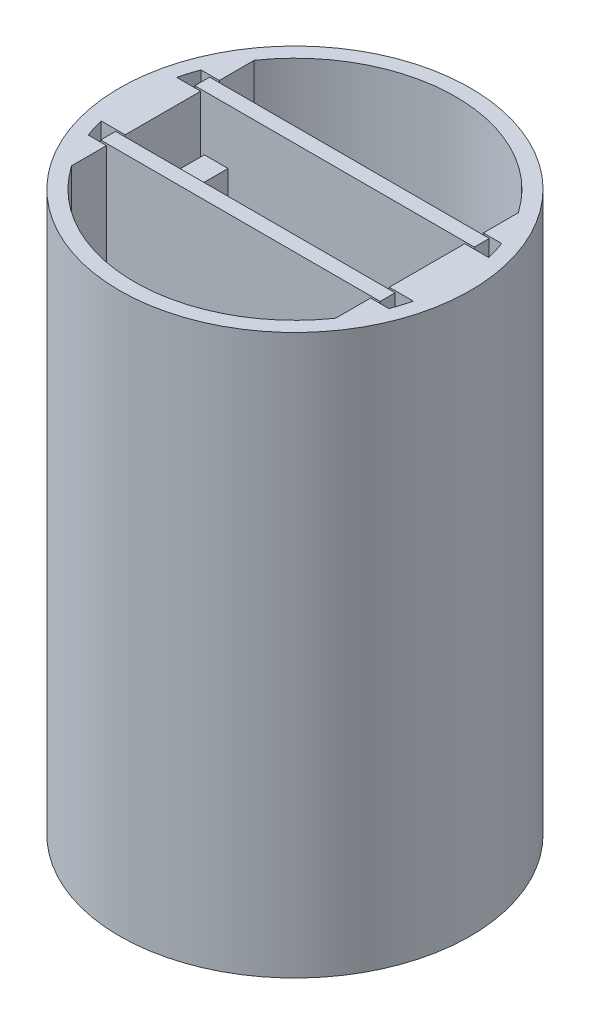
ISO-10303-21;
HEADER;
FILE_DESCRIPTION(('STEP AP214'),'2;1');
FILE_NAME('part.step','',(''),(''),'','','');
FILE_SCHEMA(('AUTOMOTIVE_DESIGN { 1 0 10303 214 1 1 1 1 }'));
ENDSEC;
DATA;
#1=APPLICATION_CONTEXT('core data for automotive mechanical design processes');
#2=APPLICATION_PROTOCOL_DEFINITION('international standard','automotive_design',2000,#1);
#3=PRODUCT_CONTEXT('',#1,'mechanical');
#4=PRODUCT('Part','Part','',(#3));
#5=PRODUCT_RELATED_PRODUCT_CATEGORY('part','',(#4));
#6=PRODUCT_DEFINITION_FORMATION('','',#4);
#7=PRODUCT_DEFINITION_CONTEXT('part definition',#1,'design');
#8=PRODUCT_DEFINITION('design','',#6,#7);
#9=PRODUCT_DEFINITION_SHAPE('','',#8);
#10=(LENGTH_UNIT() NAMED_UNIT(*) SI_UNIT(.MILLI.,.METRE.));
#11=(NAMED_UNIT(*) PLANE_ANGLE_UNIT() SI_UNIT($,.RADIAN.));
#12=(NAMED_UNIT(*) SI_UNIT($,.STERADIAN.) SOLID_ANGLE_UNIT());
#13=UNCERTAINTY_MEASURE_WITH_UNIT(LENGTH_MEASURE(1.E-05),#10,'distance_accuracy_value','');
#14=(GEOMETRIC_REPRESENTATION_CONTEXT(3) GLOBAL_UNCERTAINTY_ASSIGNED_CONTEXT((#13)) GLOBAL_UNIT_ASSIGNED_CONTEXT((#10,
#11,#12)) REPRESENTATION_CONTEXT('',''));
#15=CARTESIAN_POINT('',(0.,0.,0.));
#16=DIRECTION('',(0.,0.,1.));
#17=DIRECTION('',(1.,0.,0.));
#18=AXIS2_PLACEMENT_3D('',#15,#16,#17);
#19=CARTESIAN_POINT('',(15.,55.,-5.85));
#20=DIRECTION('',(0.,-1.,0.));
#21=DIRECTION('',(0.,0.,-1.));
#22=AXIS2_PLACEMENT_3D('',#19,#20,#21);
#23=CYLINDRICAL_SURFACE('',#22,17.2286381240384);
#24=CARTESIAN_POINT('',(15.,-5.,-5.85));
#25=DIRECTION('',(0.,1.,0.));
#26=DIRECTION('',(0.,0.,1.));
#27=AXIS2_PLACEMENT_3D('',#24,#25,#26);
#28=CIRCLE('',#27,17.2286381240384);
#29=CARTESIAN_POINT('',(0.829999999999991,-5.,3.94985059116053));
#30=VERTEX_POINT('',#29);
#31=CARTESIAN_POINT('',(29.17,-5.,3.94985059116052));
#32=VERTEX_POINT('',#31);
#33=EDGE_CURVE('E214',#30,#32,#28,.T.);
#34=ORIENTED_EDGE('',*,*,#33,.F.);
#35=DIRECTION('',(0.,-1.,0.));
#36=VECTOR('',#35,1.);
#37=CARTESIAN_POINT('',(0.829999999999991,55.,3.94985059116053));
#38=LINE('',#37,#36);
#39=CARTESIAN_POINT('',(0.829999999999991,55.,3.94985059116053));
#40=VERTEX_POINT('',#39);
#41=EDGE_CURVE('E12',#40,#30,#38,.T.);
#42=ORIENTED_EDGE('',*,*,#41,.F.);
#43=CARTESIAN_POINT('',(15.,55.,-5.85));
#44=DIRECTION('',(0.,1.,0.));
#45=DIRECTION('',(0.,0.,1.));
#46=AXIS2_PLACEMENT_3D('',#43,#44,#45);
#47=CIRCLE('',#46,17.2286381240384);
#48=CARTESIAN_POINT('',(29.17,55.,3.94985059116052));
#49=VERTEX_POINT('',#48);
#50=EDGE_CURVE('E204',#40,#49,#47,.T.);
#51=ORIENTED_EDGE('',*,*,#50,.T.);
#52=DIRECTION('',(0.,-1.,0.));
#53=VECTOR('',#52,1.);
#54=CARTESIAN_POINT('',(29.17,55.,3.94985059116052));
#55=LINE('',#54,#53);
#56=EDGE_CURVE('E129',#49,#32,#55,.T.);
#57=ORIENTED_EDGE('',*,*,#56,.T.);
#58=EDGE_LOOP('',(#34,#42,#51,#57));
#59=FACE_BOUND('',#58,.T.);
#60=ADVANCED_FACE('F42',(#59),#23,.F.);
#61=CARTESIAN_POINT('',(0.829999999999989,55.,0.));
#62=DIRECTION('',(1.,0.,0.));
#63=DIRECTION('',(0.,0.,-1.));
#64=AXIS2_PLACEMENT_3D('',#61,#62,#63);
#65=PLANE('',#64);
#66=DIRECTION('',(0.,0.,1.));
#67=VECTOR('',#66,1.);
#68=CARTESIAN_POINT('',(0.829999999999989,-5.,0.));
#69=LINE('',#68,#67);
#70=CARTESIAN_POINT('',(0.829999999999989,-5.,0.2));
#71=VERTEX_POINT('',#70);
#72=EDGE_CURVE('E217',#71,#30,#69,.T.);
#73=ORIENTED_EDGE('',*,*,#72,.F.);
#74=DIRECTION('',(0.,-1.,0.));
#75=VECTOR('',#74,1.);
#76=CARTESIAN_POINT('',(0.829999999999989,55.,0.2));
#77=LINE('',#76,#75);
#78=CARTESIAN_POINT('',(0.829999999999989,55.,0.2));
#79=VERTEX_POINT('',#78);
#80=EDGE_CURVE('E51',#79,#71,#77,.T.);
#81=ORIENTED_EDGE('',*,*,#80,.F.);
#82=DIRECTION('',(0.,0.,1.));
#83=VECTOR('',#82,1.);
#84=CARTESIAN_POINT('',(0.829999999999989,55.,0.));
#85=LINE('',#84,#83);
#86=EDGE_CURVE('E309',#79,#40,#85,.T.);
#87=ORIENTED_EDGE('',*,*,#86,.T.);
#88=ORIENTED_EDGE('',*,*,#41,.T.);
#89=EDGE_LOOP('',(#73,#81,#87,#88));
#90=FACE_BOUND('',#89,.T.);
#91=ADVANCED_FACE('F44',(#90),#65,.T.);
#92=CARTESIAN_POINT('',(0.,55.,0.2));
#93=DIRECTION('',(0.,0.,1.));
#94=DIRECTION('',(1.,0.,0.));
#95=AXIS2_PLACEMENT_3D('',#92,#93,#94);
#96=PLANE('',#95);
#97=DIRECTION('',(-1.,0.,0.));
#98=VECTOR('',#97,1.);
#99=CARTESIAN_POINT('',(0.,-5.,0.2));
#100=LINE('',#99,#98);
#101=CARTESIAN_POINT('',(-1.13144356866644,-5.,0.199999999999998));
#102=VERTEX_POINT('',#101);
#103=EDGE_CURVE('E221',#71,#102,#100,.T.);
#104=ORIENTED_EDGE('',*,*,#103,.T.);
#105=DIRECTION('',(0.,-1.,0.));
#106=VECTOR('',#105,1.);
#107=CARTESIAN_POINT('',(-1.13144356866644,55.,0.199999999999998));
#108=LINE('',#107,#106);
#109=CARTESIAN_POINT('',(-1.13144356866644,55.,0.199999999999998));
#110=VERTEX_POINT('',#109);
#111=EDGE_CURVE('E293',#110,#102,#108,.T.);
#112=ORIENTED_EDGE('',*,*,#111,.F.);
#113=DIRECTION('',(-1.,0.,0.));
#114=VECTOR('',#113,1.);
#115=CARTESIAN_POINT('',(0.,55.,0.2));
#116=LINE('',#115,#114);
#117=EDGE_CURVE('E300',#79,#110,#116,.T.);
#118=ORIENTED_EDGE('',*,*,#117,.F.);
#119=ORIENTED_EDGE('',*,*,#80,.T.);
#120=EDGE_LOOP('',(#104,#112,#118,#119));
#121=FACE_BOUND('',#120,.T.);
#122=ADVANCED_FACE('F297',(#121),#96,.F.);
#123=CARTESIAN_POINT('',(-1.74584938452122,-5.,-1.8));
#124=VERTEX_POINT('',#123);
#125=EDGE_CURVE('E218',#124,#102,#28,.T.);
#126=ORIENTED_EDGE('',*,*,#125,.F.);
#127=DIRECTION('',(0.,-1.,0.));
#128=VECTOR('',#127,1.);
#129=CARTESIAN_POINT('',(-1.74584938452122,55.,-1.8));
#130=LINE('',#129,#128);
#131=CARTESIAN_POINT('',(-1.74584938452122,55.,-1.8));
#132=VERTEX_POINT('',#131);
#133=EDGE_CURVE('E291',#132,#124,#130,.T.);
#134=ORIENTED_EDGE('',*,*,#133,.F.);
#135=EDGE_CURVE('E311',#132,#110,#47,.T.);
#136=ORIENTED_EDGE('',*,*,#135,.T.);
#137=ORIENTED_EDGE('',*,*,#111,.T.);
#138=EDGE_LOOP('',(#126,#134,#136,#137));
#139=FACE_BOUND('',#138,.T.);
#140=ADVANCED_FACE('F385',(#139),#23,.F.);
#141=CARTESIAN_POINT('',(0.,55.,-1.8));
#142=DIRECTION('',(0.,0.,1.));
#143=DIRECTION('',(1.,0.,0.));
#144=AXIS2_PLACEMENT_3D('',#141,#142,#143);
#145=PLANE('',#144);
#146=DIRECTION('',(-1.,0.,0.));
#147=VECTOR('',#146,1.);
#148=CARTESIAN_POINT('',(0.,-5.,-1.8));
#149=LINE('',#148,#147);
#150=CARTESIAN_POINT('',(0.829999999999989,-5.,-1.8));
#151=VERTEX_POINT('',#150);
#152=EDGE_CURVE('E224',#151,#124,#149,.T.);
#153=ORIENTED_EDGE('',*,*,#152,.F.);
#154=DIRECTION('',(0.,-1.,0.));
#155=VECTOR('',#154,1.);
#156=CARTESIAN_POINT('',(0.829999999999989,55.,-1.8));
#157=LINE('',#156,#155);
#158=CARTESIAN_POINT('',(0.829999999999989,55.,-1.8));
#159=VERTEX_POINT('',#158);
#160=EDGE_CURVE('E289',#159,#151,#157,.T.);
#161=ORIENTED_EDGE('',*,*,#160,.F.);
#162=DIRECTION('',(-1.,0.,0.));
#163=VECTOR('',#162,1.);
#164=CARTESIAN_POINT('',(0.,55.,-1.8));
#165=LINE('',#164,#163);
#166=EDGE_CURVE('E314',#159,#132,#165,.T.);
#167=ORIENTED_EDGE('',*,*,#166,.T.);
#168=ORIENTED_EDGE('',*,*,#133,.T.);
#169=EDGE_LOOP('',(#153,#161,#167,#168));
#170=FACE_BOUND('',#169,.T.);
#171=ADVANCED_FACE('F383',(#170),#145,.T.);
#172=CARTESIAN_POINT('',(0.829999999999989,55.,0.));
#173=DIRECTION('',(1.,0.,0.));
#174=DIRECTION('',(0.,0.,-1.));
#175=AXIS2_PLACEMENT_3D('',#172,#173,#174);
#176=PLANE('',#175);
#177=DIRECTION('',(0.,0.,1.));
#178=VECTOR('',#177,1.);
#179=CARTESIAN_POINT('',(0.829999999999989,-5.,0.));
#180=LINE('',#179,#178);
#181=CARTESIAN_POINT('',(0.829999999999989,-5.,-9.9));
#182=VERTEX_POINT('',#181);
#183=EDGE_CURVE('E227',#182,#151,#180,.T.);
#184=ORIENTED_EDGE('',*,*,#183,.F.);
#185=DIRECTION('',(0.,-1.,0.));
#186=VECTOR('',#185,1.);
#187=CARTESIAN_POINT('',(0.829999999999989,55.,-9.9));
#188=LINE('',#187,#186);
#189=CARTESIAN_POINT('',(0.829999999999989,55.,-9.9));
#190=VERTEX_POINT('',#189);
#191=EDGE_CURVE('E287',#190,#182,#188,.T.);
#192=ORIENTED_EDGE('',*,*,#191,.F.);
#193=DIRECTION('',(0.,0.,1.));
#194=VECTOR('',#193,1.);
#195=CARTESIAN_POINT('',(0.829999999999989,55.,0.));
#196=LINE('',#195,#194);
#197=EDGE_CURVE('E319',#190,#159,#196,.T.);
#198=ORIENTED_EDGE('',*,*,#197,.T.);
#199=ORIENTED_EDGE('',*,*,#160,.T.);
#200=EDGE_LOOP('',(#184,#192,#198,#199));
#201=FACE_BOUND('',#200,.T.);
#202=ADVANCED_FACE('F380',(#201),#176,.T.);
#203=CARTESIAN_POINT('',(0.,55.,-9.9));
#204=DIRECTION('',(0.,0.,-1.));
#205=DIRECTION('',(-1.,0.,0.));
#206=AXIS2_PLACEMENT_3D('',#203,#204,#205);
#207=PLANE('',#206);
#208=DIRECTION('',(1.,0.,0.));
#209=VECTOR('',#208,1.);
#210=CARTESIAN_POINT('',(0.,-5.,-9.9));
#211=LINE('',#210,#209);
#212=CARTESIAN_POINT('',(-1.74584938452122,-5.,-9.9));
#213=VERTEX_POINT('',#212);
#214=EDGE_CURVE('E230',#213,#182,#211,.T.);
#215=ORIENTED_EDGE('',*,*,#214,.F.);
#216=DIRECTION('',(0.,-1.,0.));
#217=VECTOR('',#216,1.);
#218=CARTESIAN_POINT('',(-1.74584938452122,55.,-9.9));
#219=LINE('',#218,#217);
#220=CARTESIAN_POINT('',(-1.74584938452122,55.,-9.9));
#221=VERTEX_POINT('',#220);
#222=EDGE_CURVE('E285',#221,#213,#219,.T.);
#223=ORIENTED_EDGE('',*,*,#222,.F.);
#224=DIRECTION('',(1.,0.,0.));
#225=VECTOR('',#224,1.);
#226=CARTESIAN_POINT('',(0.,55.,-9.9));
#227=LINE('',#226,#225);
#228=EDGE_CURVE('E324',#221,#190,#227,.T.);
#229=ORIENTED_EDGE('',*,*,#228,.T.);
#230=ORIENTED_EDGE('',*,*,#191,.T.);
#231=EDGE_LOOP('',(#215,#223,#229,#230));
#232=FACE_BOUND('',#231,.T.);
#233=ADVANCED_FACE('F375',(#232),#207,.T.);
#234=CARTESIAN_POINT('',(-1.13144356866644,-5.,-11.9));
#235=VERTEX_POINT('',#234);
#236=EDGE_CURVE('E233',#235,#213,#28,.T.);
#237=ORIENTED_EDGE('',*,*,#236,.F.);
#238=DIRECTION('',(0.,-1.,0.));
#239=VECTOR('',#238,1.);
#240=CARTESIAN_POINT('',(-1.13144356866644,55.,-11.9));
#241=LINE('',#240,#239);
#242=CARTESIAN_POINT('',(-1.13144356866644,55.,-11.9));
#243=VERTEX_POINT('',#242);
#244=EDGE_CURVE('E283',#243,#235,#241,.T.);
#245=ORIENTED_EDGE('',*,*,#244,.F.);
#246=EDGE_CURVE('E315',#243,#221,#47,.T.);
#247=ORIENTED_EDGE('',*,*,#246,.T.);
#248=ORIENTED_EDGE('',*,*,#222,.T.);
#249=EDGE_LOOP('',(#237,#245,#247,#248));
#250=FACE_BOUND('',#249,.T.);
#251=ADVANCED_FACE('F372',(#250),#23,.F.);
#252=CARTESIAN_POINT('',(0.,55.,-11.9));
#253=DIRECTION('',(0.,0.,1.));
#254=DIRECTION('',(1.,0.,0.));
#255=AXIS2_PLACEMENT_3D('',#252,#253,#254);
#256=PLANE('',#255);
#257=DIRECTION('',(-1.,0.,0.));
#258=VECTOR('',#257,1.);
#259=CARTESIAN_POINT('',(0.,-5.,-11.9));
#260=LINE('',#259,#258);
#261=CARTESIAN_POINT('',(0.829999999999989,-5.,-11.9));
#262=VERTEX_POINT('',#261);
#263=EDGE_CURVE('E234',#262,#235,#260,.T.);
#264=ORIENTED_EDGE('',*,*,#263,.F.);
#265=DIRECTION('',(0.,-1.,0.));
#266=VECTOR('',#265,1.);
#267=CARTESIAN_POINT('',(0.829999999999989,55.,-11.9));
#268=LINE('',#267,#266);
#269=CARTESIAN_POINT('',(0.829999999999989,55.,-11.9));
#270=VERTEX_POINT('',#269);
#271=EDGE_CURVE('E281',#270,#262,#268,.T.);
#272=ORIENTED_EDGE('',*,*,#271,.F.);
#273=DIRECTION('',(-1.,0.,0.));
#274=VECTOR('',#273,1.);
#275=CARTESIAN_POINT('',(0.,55.,-11.9));
#276=LINE('',#275,#274);
#277=EDGE_CURVE('E323',#270,#243,#276,.T.);
#278=ORIENTED_EDGE('',*,*,#277,.T.);
#279=ORIENTED_EDGE('',*,*,#244,.T.);
#280=EDGE_LOOP('',(#264,#272,#278,#279));
#281=FACE_BOUND('',#280,.T.);
#282=ADVANCED_FACE('F396',(#281),#256,.T.);
#283=CARTESIAN_POINT('',(0.829999999999979,55.,0.));
#284=DIRECTION('',(-1.,0.,0.));
#285=DIRECTION('',(0.,0.,1.));
#286=AXIS2_PLACEMENT_3D('',#283,#284,#285);
#287=PLANE('',#286);
#288=DIRECTION('',(0.,0.,-1.));
#289=VECTOR('',#288,1.);
#290=CARTESIAN_POINT('',(0.829999999999979,-5.,0.));
#291=LINE('',#290,#289);
#292=CARTESIAN_POINT('',(0.829999999999991,-5.,-15.6498505911605));
#293=VERTEX_POINT('',#292);
#294=EDGE_CURVE('E237',#262,#293,#291,.T.);
#295=ORIENTED_EDGE('',*,*,#294,.T.);
#296=DIRECTION('',(0.,-1.,0.));
#297=VECTOR('',#296,1.);
#298=CARTESIAN_POINT('',(0.829999999999991,55.,-15.6498505911605));
#299=LINE('',#298,#297);
#300=CARTESIAN_POINT('',(0.829999999999991,55.,-15.6498505911605));
#301=VERTEX_POINT('',#300);
#302=EDGE_CURVE('E279',#301,#293,#299,.T.);
#303=ORIENTED_EDGE('',*,*,#302,.F.);
#304=DIRECTION('',(0.,0.,-1.));
#305=VECTOR('',#304,1.);
#306=CARTESIAN_POINT('',(0.829999999999979,55.,0.));
#307=LINE('',#306,#305);
#308=EDGE_CURVE('E329',#270,#301,#307,.T.);
#309=ORIENTED_EDGE('',*,*,#308,.F.);
#310=ORIENTED_EDGE('',*,*,#271,.T.);
#311=EDGE_LOOP('',(#295,#303,#309,#310));
#312=FACE_BOUND('',#311,.T.);
#313=ADVANCED_FACE('F421',(#312),#287,.F.);
#314=CARTESIAN_POINT('',(29.17,-5.,-15.6498505911605));
#315=VERTEX_POINT('',#314);
#316=EDGE_CURVE('E240',#315,#293,#28,.T.);
#317=ORIENTED_EDGE('',*,*,#316,.F.);
#318=DIRECTION('',(0.,-1.,0.));
#319=VECTOR('',#318,1.);
#320=CARTESIAN_POINT('',(29.17,55.,-15.6498505911605));
#321=LINE('',#320,#319);
#322=CARTESIAN_POINT('',(29.17,55.,-15.6498505911605));
#323=VERTEX_POINT('',#322);
#324=EDGE_CURVE('E277',#323,#315,#321,.T.);
#325=ORIENTED_EDGE('',*,*,#324,.F.);
#326=EDGE_CURVE('E325',#323,#301,#47,.T.);
#327=ORIENTED_EDGE('',*,*,#326,.T.);
#328=ORIENTED_EDGE('',*,*,#302,.T.);
#329=EDGE_LOOP('',(#317,#325,#327,#328));
#330=FACE_BOUND('',#329,.T.);
#331=ADVANCED_FACE('F397',(#330),#23,.F.);
#332=CARTESIAN_POINT('',(29.17,55.,0.));
#333=DIRECTION('',(-1.,0.,0.));
#334=DIRECTION('',(0.,0.,1.));
#335=AXIS2_PLACEMENT_3D('',#332,#333,#334);
#336=PLANE('',#335);
#337=DIRECTION('',(0.,0.,-1.));
#338=VECTOR('',#337,1.);
#339=CARTESIAN_POINT('',(29.17,-5.,0.));
#340=LINE('',#339,#338);
#341=CARTESIAN_POINT('',(29.17,-5.,-11.9));
#342=VERTEX_POINT('',#341);
#343=EDGE_CURVE('E241',#342,#315,#340,.T.);
#344=ORIENTED_EDGE('',*,*,#343,.F.);
#345=DIRECTION('',(0.,-1.,0.));
#346=VECTOR('',#345,1.);
#347=CARTESIAN_POINT('',(29.17,55.,-11.9));
#348=LINE('',#347,#346);
#349=CARTESIAN_POINT('',(29.17,55.,-11.9));
#350=VERTEX_POINT('',#349);
#351=EDGE_CURVE('E275',#350,#342,#348,.T.);
#352=ORIENTED_EDGE('',*,*,#351,.F.);
#353=DIRECTION('',(0.,0.,-1.));
#354=VECTOR('',#353,1.);
#355=CARTESIAN_POINT('',(29.17,55.,0.));
#356=LINE('',#355,#354);
#357=EDGE_CURVE('E334',#350,#323,#356,.T.);
#358=ORIENTED_EDGE('',*,*,#357,.T.);
#359=ORIENTED_EDGE('',*,*,#324,.T.);
#360=EDGE_LOOP('',(#344,#352,#358,#359));
#361=FACE_BOUND('',#360,.T.);
#362=ADVANCED_FACE('F417',(#361),#336,.T.);
#363=CARTESIAN_POINT('',(0.,55.,-11.9));
#364=DIRECTION('',(0.,0.,-1.));
#365=DIRECTION('',(-1.,0.,0.));
#366=AXIS2_PLACEMENT_3D('',#363,#364,#365);
#367=PLANE('',#366);
#368=DIRECTION('',(1.,0.,0.));
#369=VECTOR('',#368,1.);
#370=CARTESIAN_POINT('',(0.,-5.,-11.9));
#371=LINE('',#370,#369);
#372=CARTESIAN_POINT('',(31.1314435686664,-5.,-11.9));
#373=VERTEX_POINT('',#372);
#374=EDGE_CURVE('E244',#342,#373,#371,.T.);
#375=ORIENTED_EDGE('',*,*,#374,.T.);
#376=DIRECTION('',(0.,-1.,0.));
#377=VECTOR('',#376,1.);
#378=CARTESIAN_POINT('',(31.1314435686664,55.,-11.9));
#379=LINE('',#378,#377);
#380=CARTESIAN_POINT('',(31.1314435686664,55.,-11.9));
#381=VERTEX_POINT('',#380);
#382=EDGE_CURVE('E273',#381,#373,#379,.T.);
#383=ORIENTED_EDGE('',*,*,#382,.F.);
#384=DIRECTION('',(1.,0.,0.));
#385=VECTOR('',#384,1.);
#386=CARTESIAN_POINT('',(0.,55.,-11.9));
#387=LINE('',#386,#385);
#388=EDGE_CURVE('E338',#350,#381,#387,.T.);
#389=ORIENTED_EDGE('',*,*,#388,.F.);
#390=ORIENTED_EDGE('',*,*,#351,.T.);
#391=EDGE_LOOP('',(#375,#383,#389,#390));
#392=FACE_BOUND('',#391,.T.);
#393=ADVANCED_FACE('F410',(#392),#367,.F.);
#394=CARTESIAN_POINT('',(31.7458493845212,-5.,-9.9));
#395=VERTEX_POINT('',#394);
#396=EDGE_CURVE('E247',#395,#373,#28,.T.);
#397=ORIENTED_EDGE('',*,*,#396,.F.);
#398=DIRECTION('',(0.,-1.,0.));
#399=VECTOR('',#398,1.);
#400=CARTESIAN_POINT('',(31.7458493845212,55.,-9.9));
#401=LINE('',#400,#399);
#402=CARTESIAN_POINT('',(31.7458493845212,55.,-9.9));
#403=VERTEX_POINT('',#402);
#404=EDGE_CURVE('E271',#403,#395,#401,.T.);
#405=ORIENTED_EDGE('',*,*,#404,.F.);
#406=EDGE_CURVE('E203',#403,#381,#47,.T.);
#407=ORIENTED_EDGE('',*,*,#406,.T.);
#408=ORIENTED_EDGE('',*,*,#382,.T.);
#409=EDGE_LOOP('',(#397,#405,#407,#408));
#410=FACE_BOUND('',#409,.T.);
#411=ADVANCED_FACE('F403',(#410),#23,.F.);
#412=CARTESIAN_POINT('',(0.,55.,-9.9));
#413=DIRECTION('',(0.,0.,1.));
#414=DIRECTION('',(1.,0.,0.));
#415=AXIS2_PLACEMENT_3D('',#412,#413,#414);
#416=PLANE('',#415);
#417=DIRECTION('',(-1.,0.,0.));
#418=VECTOR('',#417,1.);
#419=CARTESIAN_POINT('',(0.,-5.,-9.9));
#420=LINE('',#419,#418);
#421=CARTESIAN_POINT('',(29.17,-5.,-9.9));
#422=VERTEX_POINT('',#421);
#423=EDGE_CURVE('E248',#395,#422,#420,.T.);
#424=ORIENTED_EDGE('',*,*,#423,.T.);
#425=DIRECTION('',(0.,-1.,0.));
#426=VECTOR('',#425,1.);
#427=CARTESIAN_POINT('',(29.17,55.,-9.9));
#428=LINE('',#427,#426);
#429=CARTESIAN_POINT('',(29.17,55.,-9.9));
#430=VERTEX_POINT('',#429);
#431=EDGE_CURVE('E268',#430,#422,#428,.T.);
#432=ORIENTED_EDGE('',*,*,#431,.F.);
#433=DIRECTION('',(-1.,0.,0.));
#434=VECTOR('',#433,1.);
#435=CARTESIAN_POINT('',(0.,55.,-9.9));
#436=LINE('',#435,#434);
#437=EDGE_CURVE('E342',#403,#430,#436,.T.);
#438=ORIENTED_EDGE('',*,*,#437,.F.);
#439=ORIENTED_EDGE('',*,*,#404,.T.);
#440=EDGE_LOOP('',(#424,#432,#438,#439));
#441=FACE_BOUND('',#440,.T.);
#442=ADVANCED_FACE('F409',(#441),#416,.F.);
#443=CARTESIAN_POINT('',(29.17,55.,0.));
#444=DIRECTION('',(1.,0.,0.));
#445=DIRECTION('',(0.,0.,-1.));
#446=AXIS2_PLACEMENT_3D('',#443,#444,#445);
#447=PLANE('',#446);
#448=DIRECTION('',(0.,0.,1.));
#449=VECTOR('',#448,1.);
#450=CARTESIAN_POINT('',(29.17,-5.,0.));
#451=LINE('',#450,#449);
#452=CARTESIAN_POINT('',(29.17,-5.,-1.8));
#453=VERTEX_POINT('',#452);
#454=EDGE_CURVE('E250',#422,#453,#451,.T.);
#455=ORIENTED_EDGE('',*,*,#454,.T.);
#456=DIRECTION('',(0.,-1.,0.));
#457=VECTOR('',#456,1.);
#458=CARTESIAN_POINT('',(29.17,55.,-1.8));
#459=LINE('',#458,#457);
#460=CARTESIAN_POINT('',(29.17,55.,-1.8));
#461=VERTEX_POINT('',#460);
#462=EDGE_CURVE('E265',#461,#453,#459,.T.);
#463=ORIENTED_EDGE('',*,*,#462,.F.);
#464=DIRECTION('',(0.,0.,1.));
#465=VECTOR('',#464,1.);
#466=CARTESIAN_POINT('',(29.17,55.,0.));
#467=LINE('',#466,#465);
#468=EDGE_CURVE('E345',#430,#461,#467,.T.);
#469=ORIENTED_EDGE('',*,*,#468,.F.);
#470=ORIENTED_EDGE('',*,*,#431,.T.);
#471=EDGE_LOOP('',(#455,#463,#469,#470));
#472=FACE_BOUND('',#471,.T.);
#473=ADVANCED_FACE('F356',(#472),#447,.F.);
#474=CARTESIAN_POINT('',(0.,55.,-1.8));
#475=DIRECTION('',(0.,0.,-1.));
#476=DIRECTION('',(-1.,0.,0.));
#477=AXIS2_PLACEMENT_3D('',#474,#475,#476);
#478=PLANE('',#477);
#479=DIRECTION('',(1.,0.,0.));
#480=VECTOR('',#479,1.);
#481=CARTESIAN_POINT('',(0.,-5.,-1.8));
#482=LINE('',#481,#480);
#483=CARTESIAN_POINT('',(31.7458493845212,-5.,-1.8));
#484=VERTEX_POINT('',#483);
#485=EDGE_CURVE('E252',#453,#484,#482,.T.);
#486=ORIENTED_EDGE('',*,*,#485,.T.);
#487=DIRECTION('',(0.,-1.,0.));
#488=VECTOR('',#487,1.);
#489=CARTESIAN_POINT('',(31.7458493845212,55.,-1.8));
#490=LINE('',#489,#488);
#491=CARTESIAN_POINT('',(31.7458493845212,55.,-1.8));
#492=VERTEX_POINT('',#491);
#493=EDGE_CURVE('E194',#492,#484,#490,.T.);
#494=ORIENTED_EDGE('',*,*,#493,.F.);
#495=DIRECTION('',(1.,0.,0.));
#496=VECTOR('',#495,1.);
#497=CARTESIAN_POINT('',(0.,55.,-1.8));
#498=LINE('',#497,#496);
#499=EDGE_CURVE('E200',#461,#492,#498,.T.);
#500=ORIENTED_EDGE('',*,*,#499,.F.);
#501=ORIENTED_EDGE('',*,*,#462,.T.);
#502=EDGE_LOOP('',(#486,#494,#500,#501));
#503=FACE_BOUND('',#502,.T.);
#504=ADVANCED_FACE('F360',(#503),#478,.F.);
#505=CARTESIAN_POINT('',(31.1314435686664,-5.,0.199999999999998));
#506=VERTEX_POINT('',#505);
#507=EDGE_CURVE('E189',#506,#484,#28,.T.);
#508=ORIENTED_EDGE('',*,*,#507,.F.);
#509=DIRECTION('',(0.,-1.,0.));
#510=VECTOR('',#509,1.);
#511=CARTESIAN_POINT('',(31.1314435686664,55.,0.199999999999998));
#512=LINE('',#511,#510);
#513=CARTESIAN_POINT('',(31.1314435686664,55.,0.199999999999998));
#514=VERTEX_POINT('',#513);
#515=EDGE_CURVE('E184',#514,#506,#512,.T.);
#516=ORIENTED_EDGE('',*,*,#515,.F.);
#517=EDGE_CURVE('E187',#514,#492,#47,.T.);
#518=ORIENTED_EDGE('',*,*,#517,.T.);
#519=ORIENTED_EDGE('',*,*,#493,.T.);
#520=EDGE_LOOP('',(#508,#516,#518,#519));
#521=FACE_BOUND('',#520,.T.);
#522=ADVANCED_FACE('F186',(#521),#23,.F.);
#523=CARTESIAN_POINT('',(0.,55.,0.200000000000005));
#524=DIRECTION('',(0.,0.,-1.));
#525=DIRECTION('',(-1.,0.,0.));
#526=AXIS2_PLACEMENT_3D('',#523,#524,#525);
#527=PLANE('',#526);
#528=DIRECTION('',(1.,0.,0.));
#529=VECTOR('',#528,1.);
#530=CARTESIAN_POINT('',(0.,-5.,0.200000000000005));
#531=LINE('',#530,#529);
#532=CARTESIAN_POINT('',(29.17,-5.,0.2));
#533=VERTEX_POINT('',#532);
#534=EDGE_CURVE('E255',#533,#506,#531,.T.);
#535=ORIENTED_EDGE('',*,*,#534,.F.);
#536=DIRECTION('',(0.,-1.,0.));
#537=VECTOR('',#536,1.);
#538=CARTESIAN_POINT('',(29.17,55.,0.2));
#539=LINE('',#538,#537);
#540=CARTESIAN_POINT('',(29.17,55.,0.2));
#541=VERTEX_POINT('',#540);
#542=EDGE_CURVE('E122',#541,#533,#539,.T.);
#543=ORIENTED_EDGE('',*,*,#542,.F.);
#544=DIRECTION('',(1.,0.,0.));
#545=VECTOR('',#544,1.);
#546=CARTESIAN_POINT('',(0.,55.,0.200000000000005));
#547=LINE('',#546,#545);
#548=EDGE_CURVE('E198',#541,#514,#547,.T.);
#549=ORIENTED_EDGE('',*,*,#548,.T.);
#550=ORIENTED_EDGE('',*,*,#515,.T.);
#551=EDGE_LOOP('',(#535,#543,#549,#550));
#552=FACE_BOUND('',#551,.T.);
#553=ADVANCED_FACE('F205',(#552),#527,.T.);
#554=CARTESIAN_POINT('',(29.17,55.,0.));
#555=DIRECTION('',(1.,0.,0.));
#556=DIRECTION('',(0.,0.,-1.));
#557=AXIS2_PLACEMENT_3D('',#554,#555,#556);
#558=PLANE('',#557);
#559=DIRECTION('',(0.,0.,1.));
#560=VECTOR('',#559,1.);
#561=CARTESIAN_POINT('',(29.17,-5.,0.));
#562=LINE('',#561,#560);
#563=EDGE_CURVE('E257',#533,#32,#562,.T.);
#564=ORIENTED_EDGE('',*,*,#563,.T.);
#565=ORIENTED_EDGE('',*,*,#56,.F.);
#566=DIRECTION('',(0.,0.,1.));
#567=VECTOR('',#566,1.);
#568=CARTESIAN_POINT('',(29.17,55.,0.));
#569=LINE('',#568,#567);
#570=EDGE_CURVE('E59',#541,#49,#569,.T.);
#571=ORIENTED_EDGE('',*,*,#570,.F.);
#572=ORIENTED_EDGE('',*,*,#542,.T.);
#573=EDGE_LOOP('',(#564,#565,#571,#572));
#574=FACE_BOUND('',#573,.T.);
#575=ADVANCED_FACE('F310',(#574),#558,.F.);
#576=CARTESIAN_POINT('',(15.,55.,-5.85));
#577=DIRECTION('',(0.,-1.,0.));
#578=DIRECTION('',(0.,0.,-1.));
#579=AXIS2_PLACEMENT_3D('',#576,#577,#578);
#580=CYLINDRICAL_SURFACE('',#579,18.8286381240384);
#581=CARTESIAN_POINT('',(15.,55.,-5.85));
#582=DIRECTION('',(0.,1.,0.));
#583=DIRECTION('',(0.,0.,1.));
#584=AXIS2_PLACEMENT_3D('',#581,#582,#583);
#585=CIRCLE('',#584,18.8286381240384);
#586=CARTESIAN_POINT('',(15.,55.,12.9786381240384));
#587=VERTEX_POINT('',#586);
#588=EDGE_CURVE('E207',#587,#587,#585,.T.);
#589=ORIENTED_EDGE('',*,*,#588,.F.);
#590=EDGE_LOOP('',(#589));
#591=FACE_BOUND('',#590,.T.);
#592=CARTESIAN_POINT('',(15.,-5.,-5.85));
#593=DIRECTION('',(0.,1.,0.));
#594=DIRECTION('',(0.,0.,1.));
#595=AXIS2_PLACEMENT_3D('',#592,#593,#594);
#596=CIRCLE('',#595,18.8286381240384);
#597=CARTESIAN_POINT('',(15.,-5.,12.9786381240384));
#598=VERTEX_POINT('',#597);
#599=EDGE_CURVE('E259',#598,#598,#596,.T.);
#600=ORIENTED_EDGE('',*,*,#599,.T.);
#601=EDGE_LOOP('',(#600));
#602=FACE_BOUND('',#601,.T.);
#603=ADVANCED_FACE('F524',(#591,#602),#580,.T.);
#604=CARTESIAN_POINT('',(0.,55.,0.));
#605=DIRECTION('',(0.,1.,0.));
#606=DIRECTION('',(0.,0.,1.));
#607=AXIS2_PLACEMENT_3D('',#604,#605,#606);
#608=PLANE('',#607);
#609=ORIENTED_EDGE('',*,*,#50,.F.);
#610=ORIENTED_EDGE('',*,*,#86,.F.);
#611=ORIENTED_EDGE('',*,*,#117,.T.);
#612=ORIENTED_EDGE('',*,*,#135,.F.);
#613=ORIENTED_EDGE('',*,*,#166,.F.);
#614=ORIENTED_EDGE('',*,*,#197,.F.);
#615=ORIENTED_EDGE('',*,*,#228,.F.);
#616=ORIENTED_EDGE('',*,*,#246,.F.);
#617=ORIENTED_EDGE('',*,*,#277,.F.);
#618=ORIENTED_EDGE('',*,*,#308,.T.);
#619=ORIENTED_EDGE('',*,*,#326,.F.);
#620=ORIENTED_EDGE('',*,*,#357,.F.);
#621=ORIENTED_EDGE('',*,*,#388,.T.);
#622=ORIENTED_EDGE('',*,*,#406,.F.);
#623=ORIENTED_EDGE('',*,*,#437,.T.);
#624=ORIENTED_EDGE('',*,*,#468,.T.);
#625=ORIENTED_EDGE('',*,*,#499,.T.);
#626=ORIENTED_EDGE('',*,*,#517,.F.);
#627=ORIENTED_EDGE('',*,*,#548,.F.);
#628=ORIENTED_EDGE('',*,*,#570,.T.);
#629=EDGE_LOOP('',(#609,#610,#611,#612,#613,#614,#615,#616,#617,#618,#619,#620,#621,#622,#623,
#624,#625,#626,#627,#628));
#630=FACE_BOUND('',#629,.T.);
#631=ORIENTED_EDGE('',*,*,#588,.T.);
#632=EDGE_LOOP('',(#631));
#633=FACE_BOUND('',#632,.T.);
#634=ADVANCED_FACE('F196',(#630,#633),#608,.T.);
#635=CARTESIAN_POINT('',(0.,-5.,0.));
#636=DIRECTION('',(0.,1.,0.));
#637=DIRECTION('',(0.,0.,1.));
#638=AXIS2_PLACEMENT_3D('',#635,#636,#637);
#639=PLANE('',#638);
#640=ORIENTED_EDGE('',*,*,#33,.T.);
#641=ORIENTED_EDGE('',*,*,#563,.F.);
#642=ORIENTED_EDGE('',*,*,#534,.T.);
#643=ORIENTED_EDGE('',*,*,#507,.T.);
#644=ORIENTED_EDGE('',*,*,#485,.F.);
#645=ORIENTED_EDGE('',*,*,#454,.F.);
#646=ORIENTED_EDGE('',*,*,#423,.F.);
#647=ORIENTED_EDGE('',*,*,#396,.T.);
#648=ORIENTED_EDGE('',*,*,#374,.F.);
#649=ORIENTED_EDGE('',*,*,#343,.T.);
#650=ORIENTED_EDGE('',*,*,#316,.T.);
#651=ORIENTED_EDGE('',*,*,#294,.F.);
#652=ORIENTED_EDGE('',*,*,#263,.T.);
#653=ORIENTED_EDGE('',*,*,#236,.T.);
#654=ORIENTED_EDGE('',*,*,#214,.T.);
#655=ORIENTED_EDGE('',*,*,#183,.T.);
#656=ORIENTED_EDGE('',*,*,#152,.T.);
#657=ORIENTED_EDGE('',*,*,#125,.T.);
#658=ORIENTED_EDGE('',*,*,#103,.F.);
#659=ORIENTED_EDGE('',*,*,#72,.T.);
#660=EDGE_LOOP('',(#640,#641,#642,#643,#644,#645,#646,#647,#648,#649,#650,#651,#652,#653,#654,
#655,#656,#657,#658,#659));
#661=FACE_BOUND('',#660,.T.);
#662=ORIENTED_EDGE('',*,*,#599,.F.);
#663=EDGE_LOOP('',(#662));
#664=FACE_BOUND('',#663,.T.);
#665=ADVANCED_FACE('F306',(#661,#664),#639,.F.);
#666=CLOSED_SHELL('',(#60,#91,#122,#140,#171,#202,#233,#251,#282,#313,#331,#362,#393,#411,#442,
#473,#504,#522,#553,#575,#603,#634,#665));
#667=MANIFOLD_SOLID_BREP('B2',#666);
#668=CARTESIAN_POINT('',(0.,0.,-1.6));
#669=DIRECTION('',(0.,0.,-1.));
#670=DIRECTION('',(-1.,0.,0.));
#671=AXIS2_PLACEMENT_3D('',#668,#669,#670);
#672=PLANE('',#671);
#673=DIRECTION('',(1.,0.,0.));
#674=VECTOR('',#673,1.);
#675=CARTESIAN_POINT('',(0.,5.91000000000013,-1.6));
#676=LINE('',#675,#674);
#677=CARTESIAN_POINT('',(26.43,5.91,-1.6));
#678=VERTEX_POINT('',#677);
#679=CARTESIAN_POINT('',(28.97,5.90999999999999,-1.6));
#680=VERTEX_POINT('',#679);
#681=EDGE_CURVE('E792',#678,#680,#676,.T.);
#682=ORIENTED_EDGE('',*,*,#681,.T.);
#683=DIRECTION('',(0.,1.,0.));
#684=VECTOR('',#683,1.);
#685=CARTESIAN_POINT('',(28.97,0.,-1.6));
#686=LINE('',#685,#684);
#687=CARTESIAN_POINT('',(28.97,49.09,-1.6));
#688=VERTEX_POINT('',#687);
#689=EDGE_CURVE('E790',#680,#688,#686,.T.);
#690=ORIENTED_EDGE('',*,*,#689,.T.);
#691=DIRECTION('',(1.,0.,0.));
#692=VECTOR('',#691,1.);
#693=CARTESIAN_POINT('',(0.,49.09,-1.6));
#694=LINE('',#693,#692);
#695=CARTESIAN_POINT('',(26.43,49.09,-1.6));
#696=VERTEX_POINT('',#695);
#697=EDGE_CURVE('E643',#696,#688,#694,.T.);
#698=ORIENTED_EDGE('',*,*,#697,.F.);
#699=DIRECTION('',(0.,1.,0.));
#700=VECTOR('',#699,1.);
#701=CARTESIAN_POINT('',(26.43,0.,-1.6));
#702=LINE('',#701,#700);
#703=EDGE_CURVE('E638',#678,#696,#702,.T.);
#704=ORIENTED_EDGE('',*,*,#703,.F.);
#705=EDGE_LOOP('',(#682,#690,#698,#704));
#706=FACE_BOUND('',#705,.T.);
#707=DIRECTION('',(0.,1.,0.));
#708=VECTOR('',#707,1.);
#709=CARTESIAN_POINT('',(0.,0.,-1.6));
#710=LINE('',#709,#708);
#711=CARTESIAN_POINT('',(0.,0.,-1.6));
#712=VERTEX_POINT('',#711);
#713=CARTESIAN_POINT('',(0.,55.,-1.6));
#714=VERTEX_POINT('',#713);
#715=EDGE_CURVE('E835',#712,#714,#710,.T.);
#716=ORIENTED_EDGE('',*,*,#715,.T.);
#717=DIRECTION('',(1.,0.,0.));
#718=VECTOR('',#717,1.);
#719=CARTESIAN_POINT('',(0.,55.,-1.6));
#720=LINE('',#719,#718);
#721=CARTESIAN_POINT('',(30.,55.,-1.6));
#722=VERTEX_POINT('',#721);
#723=EDGE_CURVE('E838',#714,#722,#720,.T.);
#724=ORIENTED_EDGE('',*,*,#723,.T.);
#725=DIRECTION('',(0.,1.,0.));
#726=VECTOR('',#725,1.);
#727=CARTESIAN_POINT('',(30.,0.,-1.6));
#728=LINE('',#727,#726);
#729=CARTESIAN_POINT('',(30.,0.,-1.6));
#730=VERTEX_POINT('',#729);
#731=EDGE_CURVE('E841',#730,#722,#728,.T.);
#732=ORIENTED_EDGE('',*,*,#731,.F.);
#733=DIRECTION('',(1.,0.,0.));
#734=VECTOR('',#733,1.);
#735=CARTESIAN_POINT('',(0.,0.,-1.6));
#736=LINE('',#735,#734);
#737=EDGE_CURVE('E844',#712,#730,#736,.T.);
#738=ORIENTED_EDGE('',*,*,#737,.F.);
#739=EDGE_LOOP('',(#716,#724,#732,#738));
#740=FACE_BOUND('',#739,.T.);
#741=DIRECTION('',(0.,1.,0.));
#742=VECTOR('',#741,1.);
#743=CARTESIAN_POINT('',(1.02999999999999,0.,-1.6));
#744=LINE('',#743,#742);
#745=CARTESIAN_POINT('',(1.02999999999999,5.91,-1.6));
#746=VERTEX_POINT('',#745);
#747=CARTESIAN_POINT('',(1.02999999999999,49.09,-1.6));
#748=VERTEX_POINT('',#747);
#749=EDGE_CURVE('E817',#746,#748,#744,.T.);
#750=ORIENTED_EDGE('',*,*,#749,.F.);
#751=DIRECTION('',(-1.,0.,0.));
#752=VECTOR('',#751,1.);
#753=CARTESIAN_POINT('',(0.,5.91,-1.6));
#754=LINE('',#753,#752);
#755=CARTESIAN_POINT('',(3.57,5.91,-1.6));
#756=VERTEX_POINT('',#755);
#757=EDGE_CURVE('E794',#756,#746,#754,.T.);
#758=ORIENTED_EDGE('',*,*,#757,.F.);
#759=DIRECTION('',(0.,1.,0.));
#760=VECTOR('',#759,1.);
#761=CARTESIAN_POINT('',(3.57,0.,-1.6));
#762=LINE('',#761,#760);
#763=CARTESIAN_POINT('',(3.56999999999999,49.09,-1.6));
#764=VERTEX_POINT('',#763);
#765=EDGE_CURVE('E806',#756,#764,#762,.T.);
#766=ORIENTED_EDGE('',*,*,#765,.T.);
#767=DIRECTION('',(-1.,0.,0.));
#768=VECTOR('',#767,1.);
#769=CARTESIAN_POINT('',(0.,49.09,-1.6));
#770=LINE('',#769,#768);
#771=EDGE_CURVE('E820',#764,#748,#770,.T.);
#772=ORIENTED_EDGE('',*,*,#771,.T.);
#773=EDGE_LOOP('',(#750,#758,#766,#772));
#774=FACE_BOUND('',#773,.T.);
#775=ADVANCED_FACE('F623',(#706,#740,#774),#672,.T.);
#776=CARTESIAN_POINT('',(0.,0.,-1.6));
#777=DIRECTION('',(1.,0.,0.));
#778=DIRECTION('',(0.,0.,-1.));
#779=AXIS2_PLACEMENT_3D('',#776,#777,#778);
#780=PLANE('',#779);
#781=DIRECTION('',(0.,1.,0.));
#782=VECTOR('',#781,1.);
#783=CARTESIAN_POINT('',(0.,0.,0.));
#784=LINE('',#783,#782);
#785=CARTESIAN_POINT('',(0.,0.,0.));
#786=VERTEX_POINT('',#785);
#787=CARTESIAN_POINT('',(0.,55.,0.));
#788=VERTEX_POINT('',#787);
#789=EDGE_CURVE('E834',#786,#788,#784,.T.);
#790=ORIENTED_EDGE('',*,*,#789,.T.);
#791=DIRECTION('',(0.,0.,1.));
#792=VECTOR('',#791,1.);
#793=CARTESIAN_POINT('',(0.,55.,-1.6));
#794=LINE('',#793,#792);
#795=EDGE_CURVE('E40',#714,#788,#794,.T.);
#796=ORIENTED_EDGE('',*,*,#795,.F.);
#797=ORIENTED_EDGE('',*,*,#715,.F.);
#798=DIRECTION('',(0.,0.,1.));
#799=VECTOR('',#798,1.);
#800=CARTESIAN_POINT('',(0.,0.,-1.6));
#801=LINE('',#800,#799);
#802=EDGE_CURVE('E847',#712,#786,#801,.T.);
#803=ORIENTED_EDGE('',*,*,#802,.T.);
#804=EDGE_LOOP('',(#790,#796,#797,#803));
#805=FACE_BOUND('',#804,.T.);
#806=ADVANCED_FACE('F625',(#805),#780,.F.);
#807=CARTESIAN_POINT('',(0.,55.,-1.6));
#808=DIRECTION('',(0.,-1.,0.));
#809=DIRECTION('',(0.,0.,-1.));
#810=AXIS2_PLACEMENT_3D('',#807,#808,#809);
#811=PLANE('',#810);
#812=DIRECTION('',(1.,0.,0.));
#813=VECTOR('',#812,1.);
#814=CARTESIAN_POINT('',(0.,55.,0.));
#815=LINE('',#814,#813);
#816=CARTESIAN_POINT('',(30.,55.,0.));
#817=VERTEX_POINT('',#816);
#818=EDGE_CURVE('E850',#788,#817,#815,.T.);
#819=ORIENTED_EDGE('',*,*,#818,.T.);
#820=DIRECTION('',(0.,0.,1.));
#821=VECTOR('',#820,1.);
#822=CARTESIAN_POINT('',(30.,55.,-1.6));
#823=LINE('',#822,#821);
#824=EDGE_CURVE('E631',#722,#817,#823,.T.);
#825=ORIENTED_EDGE('',*,*,#824,.F.);
#826=ORIENTED_EDGE('',*,*,#723,.F.);
#827=ORIENTED_EDGE('',*,*,#795,.T.);
#828=EDGE_LOOP('',(#819,#825,#826,#827));
#829=FACE_BOUND('',#828,.T.);
#830=ADVANCED_FACE('F866',(#829),#811,.F.);
#831=CARTESIAN_POINT('',(30.,0.,-1.6));
#832=DIRECTION('',(1.,0.,0.));
#833=DIRECTION('',(0.,0.,-1.));
#834=AXIS2_PLACEMENT_3D('',#831,#832,#833);
#835=PLANE('',#834);
#836=DIRECTION('',(0.,1.,0.));
#837=VECTOR('',#836,1.);
#838=CARTESIAN_POINT('',(30.,0.,0.));
#839=LINE('',#838,#837);
#840=CARTESIAN_POINT('',(30.,0.,0.));
#841=VERTEX_POINT('',#840);
#842=EDGE_CURVE('E853',#841,#817,#839,.T.);
#843=ORIENTED_EDGE('',*,*,#842,.F.);
#844=DIRECTION('',(0.,0.,1.));
#845=VECTOR('',#844,1.);
#846=CARTESIAN_POINT('',(30.,0.,-1.6));
#847=LINE('',#846,#845);
#848=EDGE_CURVE('E859',#730,#841,#847,.T.);
#849=ORIENTED_EDGE('',*,*,#848,.F.);
#850=ORIENTED_EDGE('',*,*,#731,.T.);
#851=ORIENTED_EDGE('',*,*,#824,.T.);
#852=EDGE_LOOP('',(#843,#849,#850,#851));
#853=FACE_BOUND('',#852,.T.);
#854=ADVANCED_FACE('F863',(#853),#835,.T.);
#855=CARTESIAN_POINT('',(0.,0.,-1.6));
#856=DIRECTION('',(0.,-1.,0.));
#857=DIRECTION('',(0.,0.,-1.));
#858=AXIS2_PLACEMENT_3D('',#855,#856,#857);
#859=PLANE('',#858);
#860=DIRECTION('',(1.,0.,0.));
#861=VECTOR('',#860,1.);
#862=CARTESIAN_POINT('',(0.,0.,0.));
#863=LINE('',#862,#861);
#864=EDGE_CURVE('E839',#786,#841,#863,.T.);
#865=ORIENTED_EDGE('',*,*,#864,.F.);
#866=ORIENTED_EDGE('',*,*,#802,.F.);
#867=ORIENTED_EDGE('',*,*,#737,.T.);
#868=ORIENTED_EDGE('',*,*,#848,.T.);
#869=EDGE_LOOP('',(#865,#866,#867,#868));
#870=FACE_BOUND('',#869,.T.);
#871=ADVANCED_FACE('F873',(#870),#859,.T.);
#872=CARTESIAN_POINT('',(0.,0.,0.));
#873=DIRECTION('',(0.,0.,-1.));
#874=DIRECTION('',(-1.,0.,0.));
#875=AXIS2_PLACEMENT_3D('',#872,#873,#874);
#876=PLANE('',#875);
#877=ORIENTED_EDGE('',*,*,#789,.F.);
#878=ORIENTED_EDGE('',*,*,#864,.T.);
#879=ORIENTED_EDGE('',*,*,#842,.T.);
#880=ORIENTED_EDGE('',*,*,#818,.F.);
#881=EDGE_LOOP('',(#877,#878,#879,#880));
#882=FACE_BOUND('',#881,.T.);
#883=ADVANCED_FACE('F870',(#882),#876,.F.);
#884=CARTESIAN_POINT('',(0.,5.91,-10.1));
#885=DIRECTION('',(0.,1.,0.));
#886=DIRECTION('',(-1.,0.,0.));
#887=AXIS2_PLACEMENT_3D('',#884,#885,#886);
#888=PLANE('',#887);
#889=ORIENTED_EDGE('',*,*,#757,.T.);
#890=DIRECTION('',(0.,0.,1.));
#891=VECTOR('',#890,1.);
#892=CARTESIAN_POINT('',(1.02999999999999,5.91,-10.1));
#893=LINE('',#892,#891);
#894=CARTESIAN_POINT('',(1.02999999999999,5.91,-10.1));
#895=VERTEX_POINT('',#894);
#896=EDGE_CURVE('E831',#895,#746,#893,.T.);
#897=ORIENTED_EDGE('',*,*,#896,.F.);
#898=DIRECTION('',(-1.,0.,0.));
#899=VECTOR('',#898,1.);
#900=CARTESIAN_POINT('',(0.,5.91,-10.1));
#901=LINE('',#900,#899);
#902=CARTESIAN_POINT('',(3.57,5.91,-10.1));
#903=VERTEX_POINT('',#902);
#904=EDGE_CURVE('E803',#903,#895,#901,.T.);
#905=ORIENTED_EDGE('',*,*,#904,.F.);
#906=DIRECTION('',(0.,0.,1.));
#907=VECTOR('',#906,1.);
#908=CARTESIAN_POINT('',(3.57,5.91,-10.1));
#909=LINE('',#908,#907);
#910=EDGE_CURVE('E814',#903,#756,#909,.T.);
#911=ORIENTED_EDGE('',*,*,#910,.T.);
#912=EDGE_LOOP('',(#889,#897,#905,#911));
#913=FACE_BOUND('',#912,.T.);
#914=ADVANCED_FACE('F889',(#913),#888,.F.);
#915=CARTESIAN_POINT('',(1.02999999999999,0.,-10.1));
#916=DIRECTION('',(1.,0.,0.));
#917=DIRECTION('',(0.,0.,-1.));
#918=AXIS2_PLACEMENT_3D('',#915,#916,#917);
#919=PLANE('',#918);
#920=ORIENTED_EDGE('',*,*,#749,.T.);
#921=DIRECTION('',(0.,0.,1.));
#922=VECTOR('',#921,1.);
#923=CARTESIAN_POINT('',(1.02999999999999,49.09,-10.1));
#924=LINE('',#923,#922);
#925=CARTESIAN_POINT('',(1.02999999999999,49.09,-10.1));
#926=VERTEX_POINT('',#925);
#927=EDGE_CURVE('E828',#926,#748,#924,.T.);
#928=ORIENTED_EDGE('',*,*,#927,.F.);
#929=DIRECTION('',(0.,1.,0.));
#930=VECTOR('',#929,1.);
#931=CARTESIAN_POINT('',(1.02999999999999,0.,-10.1));
#932=LINE('',#931,#930);
#933=EDGE_CURVE('E805',#895,#926,#932,.T.);
#934=ORIENTED_EDGE('',*,*,#933,.F.);
#935=ORIENTED_EDGE('',*,*,#896,.T.);
#936=EDGE_LOOP('',(#920,#928,#934,#935));
#937=FACE_BOUND('',#936,.T.);
#938=ADVANCED_FACE('F914',(#937),#919,.F.);
#939=CARTESIAN_POINT('',(0.,49.09,-10.1));
#940=DIRECTION('',(0.,1.,0.));
#941=DIRECTION('',(0.,0.,1.));
#942=AXIS2_PLACEMENT_3D('',#939,#940,#941);
#943=PLANE('',#942);
#944=ORIENTED_EDGE('',*,*,#771,.F.);
#945=DIRECTION('',(0.,0.,1.));
#946=VECTOR('',#945,1.);
#947=CARTESIAN_POINT('',(3.56999999999999,49.09,-10.1));
#948=LINE('',#947,#946);
#949=CARTESIAN_POINT('',(3.56999999999999,49.09,-10.1));
#950=VERTEX_POINT('',#949);
#951=EDGE_CURVE('E825',#950,#764,#948,.T.);
#952=ORIENTED_EDGE('',*,*,#951,.F.);
#953=DIRECTION('',(-1.,0.,0.));
#954=VECTOR('',#953,1.);
#955=CARTESIAN_POINT('',(0.,49.09,-10.1));
#956=LINE('',#955,#954);
#957=EDGE_CURVE('E808',#950,#926,#956,.T.);
#958=ORIENTED_EDGE('',*,*,#957,.T.);
#959=ORIENTED_EDGE('',*,*,#927,.T.);
#960=EDGE_LOOP('',(#944,#952,#958,#959));
#961=FACE_BOUND('',#960,.T.);
#962=ADVANCED_FACE('F921',(#961),#943,.T.);
#963=CARTESIAN_POINT('',(3.57,0.,-10.1));
#964=DIRECTION('',(1.,0.,0.));
#965=DIRECTION('',(0.,1.,0.));
#966=AXIS2_PLACEMENT_3D('',#963,#964,#965);
#967=PLANE('',#966);
#968=ORIENTED_EDGE('',*,*,#765,.F.);
#969=ORIENTED_EDGE('',*,*,#910,.F.);
#970=DIRECTION('',(0.,1.,0.));
#971=VECTOR('',#970,1.);
#972=CARTESIAN_POINT('',(3.57,0.,-10.1));
#973=LINE('',#972,#971);
#974=EDGE_CURVE('E811',#903,#950,#973,.T.);
#975=ORIENTED_EDGE('',*,*,#974,.T.);
#976=ORIENTED_EDGE('',*,*,#951,.T.);
#977=EDGE_LOOP('',(#968,#969,#975,#976));
#978=FACE_BOUND('',#977,.T.);
#979=ADVANCED_FACE('F928',(#978),#967,.T.);
#980=CARTESIAN_POINT('',(0.,5.91000000000013,-10.1));
#981=DIRECTION('',(0.,-1.,0.));
#982=DIRECTION('',(1.,0.,0.));
#983=AXIS2_PLACEMENT_3D('',#980,#981,#982);
#984=PLANE('',#983);
#985=ORIENTED_EDGE('',*,*,#681,.F.);
#986=DIRECTION('',(0.,0.,1.));
#987=VECTOR('',#986,1.);
#988=CARTESIAN_POINT('',(26.43,5.91,-10.1));
#989=LINE('',#988,#987);
#990=CARTESIAN_POINT('',(26.43,5.91,-10.1));
#991=VERTEX_POINT('',#990);
#992=EDGE_CURVE('E771',#991,#678,#989,.T.);
#993=ORIENTED_EDGE('',*,*,#992,.F.);
#994=DIRECTION('',(1.,0.,0.));
#995=VECTOR('',#994,1.);
#996=CARTESIAN_POINT('',(0.,5.91000000000013,-10.1));
#997=LINE('',#996,#995);
#998=CARTESIAN_POINT('',(28.97,5.90999999999999,-10.1));
#999=VERTEX_POINT('',#998);
#1000=EDGE_CURVE('E788',#991,#999,#997,.T.);
#1001=ORIENTED_EDGE('',*,*,#1000,.T.);
#1002=DIRECTION('',(0.,0.,1.));
#1003=VECTOR('',#1002,1.);
#1004=CARTESIAN_POINT('',(28.97,5.90999999999999,-10.1));
#1005=LINE('',#1004,#1003);
#1006=EDGE_CURVE('E776',#999,#680,#1005,.T.);
#1007=ORIENTED_EDGE('',*,*,#1006,.T.);
#1008=EDGE_LOOP('',(#985,#993,#1001,#1007));
#1009=FACE_BOUND('',#1008,.T.);
#1010=ADVANCED_FACE('F936',(#1009),#984,.T.);
#1011=CARTESIAN_POINT('',(26.43,0.,-10.1));
#1012=DIRECTION('',(1.,0.,0.));
#1013=DIRECTION('',(0.,1.,0.));
#1014=AXIS2_PLACEMENT_3D('',#1011,#1012,#1013);
#1015=PLANE('',#1014);
#1016=ORIENTED_EDGE('',*,*,#703,.T.);
#1017=DIRECTION('',(0.,0.,1.));
#1018=VECTOR('',#1017,1.);
#1019=CARTESIAN_POINT('',(26.43,49.09,-10.1));
#1020=LINE('',#1019,#1018);
#1021=CARTESIAN_POINT('',(26.43,49.09,-10.1));
#1022=VERTEX_POINT('',#1021);
#1023=EDGE_CURVE('E783',#1022,#696,#1020,.T.);
#1024=ORIENTED_EDGE('',*,*,#1023,.F.);
#1025=DIRECTION('',(0.,1.,0.));
#1026=VECTOR('',#1025,1.);
#1027=CARTESIAN_POINT('',(26.43,0.,-10.1));
#1028=LINE('',#1027,#1026);
#1029=EDGE_CURVE('E779',#991,#1022,#1028,.T.);
#1030=ORIENTED_EDGE('',*,*,#1029,.F.);
#1031=ORIENTED_EDGE('',*,*,#992,.T.);
#1032=EDGE_LOOP('',(#1016,#1024,#1030,#1031));
#1033=FACE_BOUND('',#1032,.T.);
#1034=ADVANCED_FACE('F944',(#1033),#1015,.F.);
#1035=CARTESIAN_POINT('',(0.,49.09,-10.1));
#1036=DIRECTION('',(0.,-1.,0.));
#1037=DIRECTION('',(0.,0.,-1.));
#1038=AXIS2_PLACEMENT_3D('',#1035,#1036,#1037);
#1039=PLANE('',#1038);
#1040=ORIENTED_EDGE('',*,*,#697,.T.);
#1041=DIRECTION('',(0.,0.,1.));
#1042=VECTOR('',#1041,1.);
#1043=CARTESIAN_POINT('',(28.97,49.09,-10.1));
#1044=LINE('',#1043,#1042);
#1045=CARTESIAN_POINT('',(28.97,49.09,-10.1));
#1046=VERTEX_POINT('',#1045);
#1047=EDGE_CURVE('E780',#1046,#688,#1044,.T.);
#1048=ORIENTED_EDGE('',*,*,#1047,.F.);
#1049=DIRECTION('',(1.,0.,0.));
#1050=VECTOR('',#1049,1.);
#1051=CARTESIAN_POINT('',(0.,49.09,-10.1));
#1052=LINE('',#1051,#1050);
#1053=EDGE_CURVE('E796',#1022,#1046,#1052,.T.);
#1054=ORIENTED_EDGE('',*,*,#1053,.F.);
#1055=ORIENTED_EDGE('',*,*,#1023,.T.);
#1056=EDGE_LOOP('',(#1040,#1048,#1054,#1055));
#1057=FACE_BOUND('',#1056,.T.);
#1058=ADVANCED_FACE('F952',(#1057),#1039,.F.);
#1059=CARTESIAN_POINT('',(28.97,0.,-10.1));
#1060=DIRECTION('',(1.,0.,0.));
#1061=DIRECTION('',(0.,0.,-1.));
#1062=AXIS2_PLACEMENT_3D('',#1059,#1060,#1061);
#1063=PLANE('',#1062);
#1064=ORIENTED_EDGE('',*,*,#689,.F.);
#1065=ORIENTED_EDGE('',*,*,#1006,.F.);
#1066=DIRECTION('',(0.,1.,0.));
#1067=VECTOR('',#1066,1.);
#1068=CARTESIAN_POINT('',(28.97,0.,-10.1));
#1069=LINE('',#1068,#1067);
#1070=EDGE_CURVE('E798',#999,#1046,#1069,.T.);
#1071=ORIENTED_EDGE('',*,*,#1070,.T.);
#1072=ORIENTED_EDGE('',*,*,#1047,.T.);
#1073=EDGE_LOOP('',(#1064,#1065,#1071,#1072));
#1074=FACE_BOUND('',#1073,.T.);
#1075=ADVANCED_FACE('F960',(#1074),#1063,.T.);
#1076=CARTESIAN_POINT('',(0.,0.,-10.1));
#1077=DIRECTION('',(0.,0.,1.));
#1078=DIRECTION('',(1.,0.,0.));
#1079=AXIS2_PLACEMENT_3D('',#1076,#1077,#1078);
#1080=PLANE('',#1079);
#1081=DIRECTION('',(0.,-1.,0.));
#1082=VECTOR('',#1081,1.);
#1083=CARTESIAN_POINT('',(0.,55.,-10.1));
#1084=LINE('',#1083,#1082);
#1085=CARTESIAN_POINT('',(0.,55.,-10.1));
#1086=VERTEX_POINT('',#1085);
#1087=CARTESIAN_POINT('',(0.,-5.,-10.1));
#1088=VERTEX_POINT('',#1087);
#1089=EDGE_CURVE('E765',#1086,#1088,#1084,.T.);
#1090=ORIENTED_EDGE('',*,*,#1089,.T.);
#1091=DIRECTION('',(1.,0.,0.));
#1092=VECTOR('',#1091,1.);
#1093=CARTESIAN_POINT('',(0.,-5.,-10.1));
#1094=LINE('',#1093,#1092);
#1095=CARTESIAN_POINT('',(30.,-5.,-10.1));
#1096=VERTEX_POINT('',#1095);
#1097=EDGE_CURVE('E739',#1088,#1096,#1094,.T.);
#1098=ORIENTED_EDGE('',*,*,#1097,.T.);
#1099=DIRECTION('',(0.,-1.,0.));
#1100=VECTOR('',#1099,1.);
#1101=CARTESIAN_POINT('',(30.,55.,-10.1));
#1102=LINE('',#1101,#1100);
#1103=CARTESIAN_POINT('',(30.,55.,-10.1));
#1104=VERTEX_POINT('',#1103);
#1105=EDGE_CURVE('E760',#1104,#1096,#1102,.T.);
#1106=ORIENTED_EDGE('',*,*,#1105,.F.);
#1107=DIRECTION('',(1.,0.,0.));
#1108=VECTOR('',#1107,1.);
#1109=CARTESIAN_POINT('',(0.,55.,-10.1));
#1110=LINE('',#1109,#1108);
#1111=EDGE_CURVE('E758',#1086,#1104,#1110,.T.);
#1112=ORIENTED_EDGE('',*,*,#1111,.F.);
#1113=EDGE_LOOP('',(#1090,#1098,#1106,#1112));
#1114=FACE_BOUND('',#1113,.T.);
#1115=ORIENTED_EDGE('',*,*,#1070,.F.);
#1116=ORIENTED_EDGE('',*,*,#1000,.F.);
#1117=ORIENTED_EDGE('',*,*,#1029,.T.);
#1118=ORIENTED_EDGE('',*,*,#1053,.T.);
#1119=EDGE_LOOP('',(#1115,#1116,#1117,#1118));
#1120=FACE_BOUND('',#1119,.T.);
#1121=ORIENTED_EDGE('',*,*,#904,.T.);
#1122=ORIENTED_EDGE('',*,*,#933,.T.);
#1123=ORIENTED_EDGE('',*,*,#957,.F.);
#1124=ORIENTED_EDGE('',*,*,#974,.F.);
#1125=EDGE_LOOP('',(#1121,#1122,#1123,#1124));
#1126=FACE_BOUND('',#1125,.T.);
#1127=ADVANCED_FACE('F968',(#1114,#1120,#1126),#1080,.T.);
#1128=CARTESIAN_POINT('',(0.,55.,-11.7));
#1129=DIRECTION('',(-1.,0.,0.));
#1130=DIRECTION('',(0.,0.,1.));
#1131=AXIS2_PLACEMENT_3D('',#1128,#1129,#1130);
#1132=PLANE('',#1131);
#1133=ORIENTED_EDGE('',*,*,#1089,.F.);
#1134=DIRECTION('',(0.,0.,1.));
#1135=VECTOR('',#1134,1.);
#1136=CARTESIAN_POINT('',(0.,55.,-11.7));
#1137=LINE('',#1136,#1135);
#1138=CARTESIAN_POINT('',(0.,55.,-11.7));
#1139=VERTEX_POINT('',#1138);
#1140=EDGE_CURVE('E756',#1139,#1086,#1137,.T.);
#1141=ORIENTED_EDGE('',*,*,#1140,.F.);
#1142=DIRECTION('',(0.,-1.,0.));
#1143=VECTOR('',#1142,1.);
#1144=CARTESIAN_POINT('',(0.,55.,-11.7));
#1145=LINE('',#1144,#1143);
#1146=CARTESIAN_POINT('',(0.,-5.,-11.7));
#1147=VERTEX_POINT('',#1146);
#1148=EDGE_CURVE('E750',#1139,#1147,#1145,.T.);
#1149=ORIENTED_EDGE('',*,*,#1148,.T.);
#1150=DIRECTION('',(0.,0.,1.));
#1151=VECTOR('',#1150,1.);
#1152=CARTESIAN_POINT('',(0.,-5.,-11.7));
#1153=LINE('',#1152,#1151);
#1154=EDGE_CURVE('E734',#1147,#1088,#1153,.T.);
#1155=ORIENTED_EDGE('',*,*,#1154,.T.);
#1156=EDGE_LOOP('',(#1133,#1141,#1149,#1155));
#1157=FACE_BOUND('',#1156,.T.);
#1158=ADVANCED_FACE('F755',(#1157),#1132,.T.);
#1159=CARTESIAN_POINT('',(0.,55.,-11.7));
#1160=DIRECTION('',(0.,-1.,0.));
#1161=DIRECTION('',(0.,0.,-1.));
#1162=AXIS2_PLACEMENT_3D('',#1159,#1160,#1161);
#1163=PLANE('',#1162);
#1164=ORIENTED_EDGE('',*,*,#1111,.T.);
#1165=DIRECTION('',(0.,0.,1.));
#1166=VECTOR('',#1165,1.);
#1167=CARTESIAN_POINT('',(30.,55.,-11.7));
#1168=LINE('',#1167,#1166);
#1169=CARTESIAN_POINT('',(30.,55.,-11.7));
#1170=VERTEX_POINT('',#1169);
#1171=EDGE_CURVE('E772',#1170,#1104,#1168,.T.);
#1172=ORIENTED_EDGE('',*,*,#1171,.F.);
#1173=DIRECTION('',(1.,0.,0.));
#1174=VECTOR('',#1173,1.);
#1175=CARTESIAN_POINT('',(0.,55.,-11.7));
#1176=LINE('',#1175,#1174);
#1177=EDGE_CURVE('E745',#1139,#1170,#1176,.T.);
#1178=ORIENTED_EDGE('',*,*,#1177,.F.);
#1179=ORIENTED_EDGE('',*,*,#1140,.T.);
#1180=EDGE_LOOP('',(#1164,#1172,#1178,#1179));
#1181=FACE_BOUND('',#1180,.T.);
#1182=ADVANCED_FACE('F983',(#1181),#1163,.F.);
#1183=CARTESIAN_POINT('',(30.,55.,-11.7));
#1184=DIRECTION('',(-1.,0.,0.));
#1185=DIRECTION('',(0.,0.,1.));
#1186=AXIS2_PLACEMENT_3D('',#1183,#1184,#1185);
#1187=PLANE('',#1186);
#1188=ORIENTED_EDGE('',*,*,#1105,.T.);
#1189=DIRECTION('',(0.,0.,1.));
#1190=VECTOR('',#1189,1.);
#1191=CARTESIAN_POINT('',(30.,-5.,-11.7));
#1192=LINE('',#1191,#1190);
#1193=CARTESIAN_POINT('',(30.,-5.,-11.7));
#1194=VERTEX_POINT('',#1193);
#1195=EDGE_CURVE('E744',#1194,#1096,#1192,.T.);
#1196=ORIENTED_EDGE('',*,*,#1195,.F.);
#1197=DIRECTION('',(0.,-1.,0.));
#1198=VECTOR('',#1197,1.);
#1199=CARTESIAN_POINT('',(30.,55.,-11.7));
#1200=LINE('',#1199,#1198);
#1201=EDGE_CURVE('E752',#1170,#1194,#1200,.T.);
#1202=ORIENTED_EDGE('',*,*,#1201,.F.);
#1203=ORIENTED_EDGE('',*,*,#1171,.T.);
#1204=EDGE_LOOP('',(#1188,#1196,#1202,#1203));
#1205=FACE_BOUND('',#1204,.T.);
#1206=ADVANCED_FACE('F990',(#1205),#1187,.F.);
#1207=CARTESIAN_POINT('',(0.,-5.,-11.7));
#1208=DIRECTION('',(0.,-1.,0.));
#1209=DIRECTION('',(0.,0.,-1.));
#1210=AXIS2_PLACEMENT_3D('',#1207,#1208,#1209);
#1211=PLANE('',#1210);
#1212=ORIENTED_EDGE('',*,*,#1097,.F.);
#1213=ORIENTED_EDGE('',*,*,#1154,.F.);
#1214=DIRECTION('',(1.,0.,0.));
#1215=VECTOR('',#1214,1.);
#1216=CARTESIAN_POINT('',(0.,-5.,-11.7));
#1217=LINE('',#1216,#1215);
#1218=EDGE_CURVE('E737',#1147,#1194,#1217,.T.);
#1219=ORIENTED_EDGE('',*,*,#1218,.T.);
#1220=ORIENTED_EDGE('',*,*,#1195,.T.);
#1221=EDGE_LOOP('',(#1212,#1213,#1219,#1220));
#1222=FACE_BOUND('',#1221,.T.);
#1223=ADVANCED_FACE('F736',(#1222),#1211,.T.);
#1224=CARTESIAN_POINT('',(0.,0.,-11.7));
#1225=DIRECTION('',(0.,0.,1.));
#1226=DIRECTION('',(1.,0.,0.));
#1227=AXIS2_PLACEMENT_3D('',#1224,#1225,#1226);
#1228=PLANE('',#1227);
#1229=ORIENTED_EDGE('',*,*,#1148,.F.);
#1230=ORIENTED_EDGE('',*,*,#1177,.T.);
#1231=ORIENTED_EDGE('',*,*,#1201,.T.);
#1232=ORIENTED_EDGE('',*,*,#1218,.F.);
#1233=EDGE_LOOP('',(#1229,#1230,#1231,#1232));
#1234=FACE_BOUND('',#1233,.T.);
#1235=ADVANCED_FACE('F749',(#1234),#1228,.F.);
#1236=CLOSED_SHELL('',(#775,#806,#830,#854,#871,#883,#914,#938,#962,#979,#1010,#1034,#1058,
#1075,#1127,#1158,#1182,#1206,#1223,#1235));
#1237=MANIFOLD_SOLID_BREP('B6',#1236);
#1238=ADVANCED_BREP_SHAPE_REPRESENTATION('',(#18,#667,#1237),#14);
#1239=SHAPE_DEFINITION_REPRESENTATION(#9,#1238);
ENDSEC;
END-ISO-10303-21;
